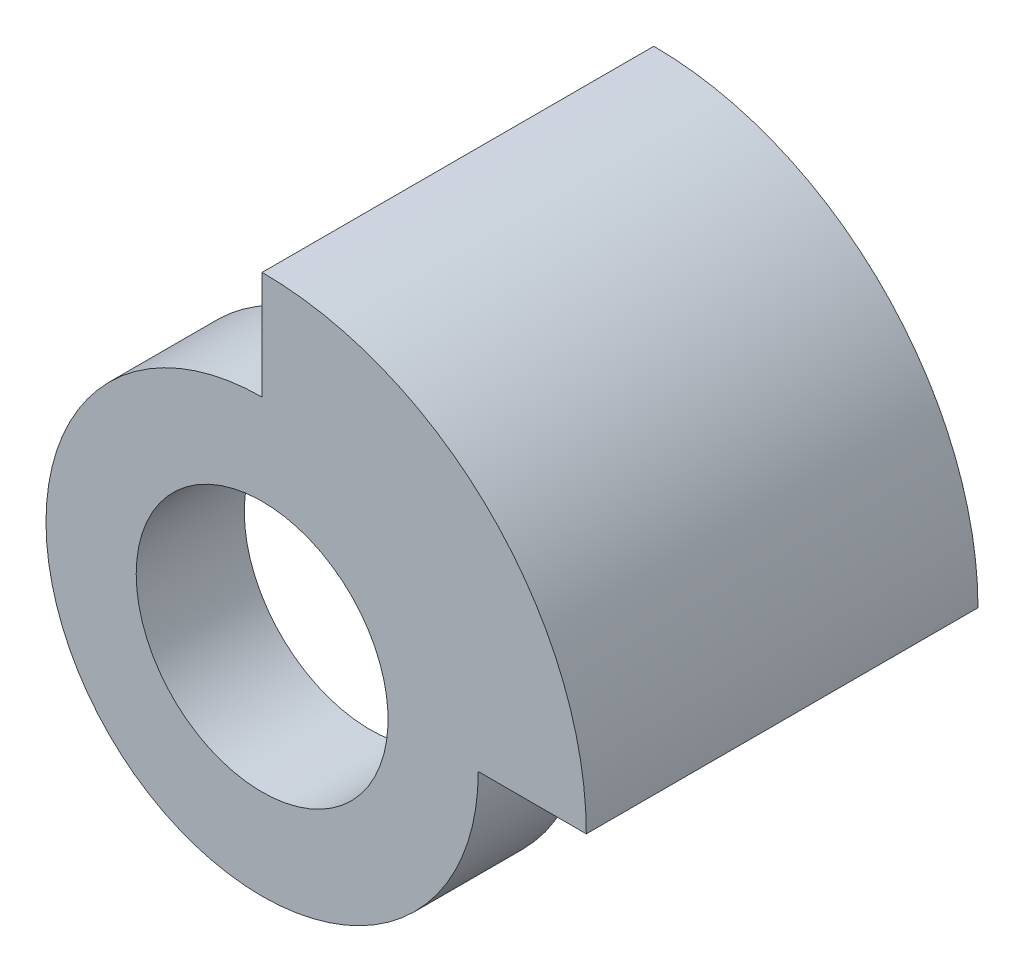
ISO-10303-21;
HEADER;
FILE_DESCRIPTION(('STEP AP214'),'2;1');
FILE_NAME('part.step','',(''),(''),'','','');
FILE_SCHEMA(('AUTOMOTIVE_DESIGN { 1 0 10303 214 1 1 1 1 }'));
ENDSEC;
DATA;
#1=APPLICATION_CONTEXT('core data for automotive mechanical design processes');
#2=APPLICATION_PROTOCOL_DEFINITION('international standard','automotive_design',2000,#1);
#3=PRODUCT_CONTEXT('',#1,'mechanical');
#4=PRODUCT('Part','Part','',(#3));
#5=PRODUCT_RELATED_PRODUCT_CATEGORY('part','',(#4));
#6=PRODUCT_DEFINITION_FORMATION('','',#4);
#7=PRODUCT_DEFINITION_CONTEXT('part definition',#1,'design');
#8=PRODUCT_DEFINITION('design','',#6,#7);
#9=PRODUCT_DEFINITION_SHAPE('','',#8);
#10=(LENGTH_UNIT() NAMED_UNIT(*) SI_UNIT(.MILLI.,.METRE.));
#11=(NAMED_UNIT(*) PLANE_ANGLE_UNIT() SI_UNIT($,.RADIAN.));
#12=(NAMED_UNIT(*) SI_UNIT($,.STERADIAN.) SOLID_ANGLE_UNIT());
#13=UNCERTAINTY_MEASURE_WITH_UNIT(LENGTH_MEASURE(1.E-05),#10,'distance_accuracy_value','');
#14=(GEOMETRIC_REPRESENTATION_CONTEXT(3) GLOBAL_UNCERTAINTY_ASSIGNED_CONTEXT((#13)) GLOBAL_UNIT_ASSIGNED_CONTEXT((#10,
#11,#12)) REPRESENTATION_CONTEXT('',''));
#15=CARTESIAN_POINT('',(0.,0.,0.));
#16=DIRECTION('',(0.,0.,1.));
#17=DIRECTION('',(1.,0.,0.));
#18=AXIS2_PLACEMENT_3D('',#15,#16,#17);
#19=CARTESIAN_POINT('',(0.,0.,0.));
#20=DIRECTION('',(0.,0.,1.));
#21=DIRECTION('',(1.,0.,0.));
#22=AXIS2_PLACEMENT_3D('',#19,#20,#21);
#23=PLANE('',#22);
#24=CARTESIAN_POINT('',(0.,0.,0.));
#25=DIRECTION('',(0.,0.,1.));
#26=DIRECTION('',(1.,0.,0.));
#27=AXIS2_PLACEMENT_3D('',#24,#25,#26);
#28=CIRCLE('',#27,11.1);
#29=CARTESIAN_POINT('',(-11.1,0.,0.));
#30=VERTEX_POINT('',#29);
#31=EDGE_CURVE('E126',#30,#30,#28,.T.);
#32=ORIENTED_EDGE('',*,*,#31,.T.);
#33=EDGE_LOOP('',(#32));
#34=FACE_BOUND('',#33,.T.);
#35=DIRECTION('',(0.,-1.,0.));
#36=VECTOR('',#35,1.);
#37=CARTESIAN_POINT('',(0.,0.,0.));
#38=LINE('',#37,#36);
#39=CARTESIAN_POINT('',(0.,19.4,0.));
#40=VERTEX_POINT('',#39);
#41=CARTESIAN_POINT('',(0.,19.0513784319709,0.));
#42=VERTEX_POINT('',#41);
#43=EDGE_CURVE('E123',#40,#42,#38,.T.);
#44=ORIENTED_EDGE('',*,*,#43,.F.);
#45=CARTESIAN_POINT('',(0.,0.,0.));
#46=DIRECTION('',(0.,0.,-1.));
#47=DIRECTION('',(-1.,0.,0.));
#48=AXIS2_PLACEMENT_3D('',#45,#46,#47);
#49=CIRCLE('',#48,19.4);
#50=CARTESIAN_POINT('',(19.4,0.,0.));
#51=VERTEX_POINT('',#50);
#52=EDGE_CURVE('E114',#40,#51,#49,.T.);
#53=ORIENTED_EDGE('',*,*,#52,.T.);
#54=DIRECTION('',(-1.,0.,0.));
#55=VECTOR('',#54,1.);
#56=CARTESIAN_POINT('',(0.,0.,0.));
#57=LINE('',#56,#55);
#58=CARTESIAN_POINT('',(19.0513784319709,0.,0.));
#59=VERTEX_POINT('',#58);
#60=EDGE_CURVE('E76',#51,#59,#57,.T.);
#61=ORIENTED_EDGE('',*,*,#60,.T.);
#62=CARTESIAN_POINT('',(0.,0.,0.));
#63=DIRECTION('',(0.,0.,1.));
#64=DIRECTION('',(1.,0.,0.));
#65=AXIS2_PLACEMENT_3D('',#62,#63,#64);
#66=CIRCLE('',#65,19.0513784319709);
#67=EDGE_CURVE('E135',#42,#59,#66,.T.);
#68=ORIENTED_EDGE('',*,*,#67,.F.);
#69=EDGE_LOOP('',(#44,#53,#61,#68));
#70=FACE_BOUND('',#69,.T.);
#71=ADVANCED_FACE('F36',(#34,#70),#23,.F.);
#72=CARTESIAN_POINT('',(0.,0.,9.525));
#73=DIRECTION('',(0.,0.,-1.));
#74=DIRECTION('',(-1.,0.,0.));
#75=AXIS2_PLACEMENT_3D('',#72,#73,#74);
#76=CYLINDRICAL_SURFACE('',#75,28.575);
#77=DIRECTION('',(0.,0.,-1.));
#78=VECTOR('',#77,1.);
#79=CARTESIAN_POINT('',(28.575,0.,9.525));
#80=LINE('',#79,#78);
#81=CARTESIAN_POINT('',(28.575,0.,9.525));
#82=VERTEX_POINT('',#81);
#83=CARTESIAN_POINT('',(28.575,0.,-25.));
#84=VERTEX_POINT('',#83);
#85=EDGE_CURVE('E60',#82,#84,#80,.T.);
#86=ORIENTED_EDGE('',*,*,#85,.T.);
#87=CARTESIAN_POINT('',(0.,0.,-25.));
#88=DIRECTION('',(0.,0.,-1.));
#89=DIRECTION('',(-1.,0.,0.));
#90=AXIS2_PLACEMENT_3D('',#87,#88,#89);
#91=CIRCLE('',#90,28.575);
#92=CARTESIAN_POINT('',(0.,28.575,-25.));
#93=VERTEX_POINT('',#92);
#94=EDGE_CURVE('E97',#93,#84,#91,.T.);
#95=ORIENTED_EDGE('',*,*,#94,.F.);
#96=DIRECTION('',(0.,0.,-1.));
#97=VECTOR('',#96,1.);
#98=CARTESIAN_POINT('',(0.,28.575,9.525));
#99=LINE('',#98,#97);
#100=CARTESIAN_POINT('',(0.,28.575,9.525));
#101=VERTEX_POINT('',#100);
#102=EDGE_CURVE('E11',#101,#93,#99,.T.);
#103=ORIENTED_EDGE('',*,*,#102,.F.);
#104=CARTESIAN_POINT('',(0.,0.,9.525));
#105=DIRECTION('',(0.,0.,1.));
#106=DIRECTION('',(1.,0.,0.));
#107=AXIS2_PLACEMENT_3D('',#104,#105,#106);
#108=CIRCLE('',#107,28.575);
#109=EDGE_CURVE('E99',#101,#82,#108,.F.);
#110=ORIENTED_EDGE('',*,*,#109,.T.);
#111=EDGE_LOOP('',(#86,#95,#103,#110));
#112=FACE_BOUND('',#111,.T.);
#113=ADVANCED_FACE('F38',(#112),#76,.T.);
#114=CARTESIAN_POINT('',(0.,0.,9.525));
#115=DIRECTION('',(1.,0.,0.));
#116=DIRECTION('',(0.,0.,-1.));
#117=AXIS2_PLACEMENT_3D('',#114,#115,#116);
#118=PLANE('',#117);
#119=ORIENTED_EDGE('',*,*,#102,.T.);
#120=DIRECTION('',(0.,1.,0.));
#121=VECTOR('',#120,1.);
#122=CARTESIAN_POINT('',(0.,0.,-25.));
#123=LINE('',#122,#121);
#124=CARTESIAN_POINT('',(0.,19.4,-25.));
#125=VERTEX_POINT('',#124);
#126=EDGE_CURVE('E113',#125,#93,#123,.T.);
#127=ORIENTED_EDGE('',*,*,#126,.F.);
#128=DIRECTION('',(0.,0.,1.));
#129=VECTOR('',#128,1.);
#130=CARTESIAN_POINT('',(0.,19.4,-25.));
#131=LINE('',#130,#129);
#132=EDGE_CURVE('E119',#125,#40,#131,.T.);
#133=ORIENTED_EDGE('',*,*,#132,.T.);
#134=ORIENTED_EDGE('',*,*,#43,.T.);
#135=DIRECTION('',(0.,0.,-1.));
#136=VECTOR('',#135,1.);
#137=CARTESIAN_POINT('',(0.,19.0513784319709,9.525));
#138=LINE('',#137,#136);
#139=CARTESIAN_POINT('',(0.,19.0513784319709,9.525));
#140=VERTEX_POINT('',#139);
#141=EDGE_CURVE('E44',#140,#42,#138,.T.);
#142=ORIENTED_EDGE('',*,*,#141,.F.);
#143=DIRECTION('',(0.,-1.,0.));
#144=VECTOR('',#143,1.);
#145=CARTESIAN_POINT('',(0.,0.,9.525));
#146=LINE('',#145,#144);
#147=EDGE_CURVE('E125',#101,#140,#146,.T.);
#148=ORIENTED_EDGE('',*,*,#147,.F.);
#149=EDGE_LOOP('',(#119,#127,#133,#134,#142,#148));
#150=FACE_BOUND('',#149,.T.);
#151=ADVANCED_FACE('F149',(#150),#118,.F.);
#152=CARTESIAN_POINT('',(0.,0.,9.525));
#153=DIRECTION('',(0.,0.,-1.));
#154=DIRECTION('',(-1.,0.,0.));
#155=AXIS2_PLACEMENT_3D('',#152,#153,#154);
#156=CYLINDRICAL_SURFACE('',#155,19.0513784319709);
#157=ORIENTED_EDGE('',*,*,#67,.T.);
#158=DIRECTION('',(0.,0.,-1.));
#159=VECTOR('',#158,1.);
#160=CARTESIAN_POINT('',(19.0513784319709,0.,9.525));
#161=LINE('',#160,#159);
#162=CARTESIAN_POINT('',(19.0513784319709,0.,9.525));
#163=VERTEX_POINT('',#162);
#164=EDGE_CURVE('E101',#163,#59,#161,.T.);
#165=ORIENTED_EDGE('',*,*,#164,.F.);
#166=CARTESIAN_POINT('',(0.,0.,9.525));
#167=DIRECTION('',(0.,0.,1.));
#168=DIRECTION('',(1.,0.,0.));
#169=AXIS2_PLACEMENT_3D('',#166,#167,#168);
#170=CIRCLE('',#169,19.0513784319709);
#171=EDGE_CURVE('E128',#140,#163,#170,.T.);
#172=ORIENTED_EDGE('',*,*,#171,.F.);
#173=ORIENTED_EDGE('',*,*,#141,.T.);
#174=EDGE_LOOP('',(#157,#165,#172,#173));
#175=FACE_BOUND('',#174,.T.);
#176=ADVANCED_FACE('F145',(#175),#156,.T.);
#177=CARTESIAN_POINT('',(0.,0.,9.525));
#178=DIRECTION('',(0.,-1.,0.));
#179=DIRECTION('',(1.,0.,0.));
#180=AXIS2_PLACEMENT_3D('',#177,#178,#179);
#181=PLANE('',#180);
#182=ORIENTED_EDGE('',*,*,#60,.F.);
#183=DIRECTION('',(0.,0.,1.));
#184=VECTOR('',#183,1.);
#185=CARTESIAN_POINT('',(19.4,0.,-25.));
#186=LINE('',#185,#184);
#187=CARTESIAN_POINT('',(19.4,0.,-25.));
#188=VERTEX_POINT('',#187);
#189=EDGE_CURVE('E51',#188,#51,#186,.T.);
#190=ORIENTED_EDGE('',*,*,#189,.F.);
#191=DIRECTION('',(-1.,0.,0.));
#192=VECTOR('',#191,1.);
#193=CARTESIAN_POINT('',(0.,0.,-25.));
#194=LINE('',#193,#192);
#195=EDGE_CURVE('E104',#84,#188,#194,.T.);
#196=ORIENTED_EDGE('',*,*,#195,.F.);
#197=ORIENTED_EDGE('',*,*,#85,.F.);
#198=DIRECTION('',(-1.,0.,0.));
#199=VECTOR('',#198,1.);
#200=CARTESIAN_POINT('',(0.,0.,9.525));
#201=LINE('',#200,#199);
#202=EDGE_CURVE('E130',#82,#163,#201,.T.);
#203=ORIENTED_EDGE('',*,*,#202,.T.);
#204=ORIENTED_EDGE('',*,*,#164,.T.);
#205=EDGE_LOOP('',(#182,#190,#196,#197,#203,#204));
#206=FACE_BOUND('',#205,.T.);
#207=ADVANCED_FACE('F105',(#206),#181,.T.);
#208=CARTESIAN_POINT('',(0.,0.,9.525));
#209=DIRECTION('',(0.,0.,-1.));
#210=DIRECTION('',(-1.,0.,0.));
#211=AXIS2_PLACEMENT_3D('',#208,#209,#210);
#212=CYLINDRICAL_SURFACE('',#211,11.1);
#213=CARTESIAN_POINT('',(0.,0.,9.525));
#214=DIRECTION('',(0.,0.,1.));
#215=DIRECTION('',(1.,0.,0.));
#216=AXIS2_PLACEMENT_3D('',#213,#214,#215);
#217=CIRCLE('',#216,11.1);
#218=CARTESIAN_POINT('',(-11.1,0.,9.525));
#219=VERTEX_POINT('',#218);
#220=EDGE_CURVE('E102',#219,#219,#217,.T.);
#221=CARTESIAN_POINT('',(-11.1,0.,9.525));
#222=CARTESIAN_POINT('',(-11.1,0.,9.42578125));
#223=CARTESIAN_POINT('',(-11.1,0.,9.3265625));
#224=CARTESIAN_POINT('',(-11.1,0.,9.128125));
#225=CARTESIAN_POINT('',(-11.1,0.,9.02890625));
#226=CARTESIAN_POINT('',(-11.1,0.,8.83046875));
#227=CARTESIAN_POINT('',(-11.1,0.,8.73125));
#228=CARTESIAN_POINT('',(-11.1,0.,8.5328125));
#229=CARTESIAN_POINT('',(-11.1,0.,8.43359375));
#230=CARTESIAN_POINT('',(-11.1,0.,8.23515625));
#231=CARTESIAN_POINT('',(-11.1,0.,8.1359375));
#232=CARTESIAN_POINT('',(-11.1,0.,7.9375));
#233=CARTESIAN_POINT('',(-11.1,0.,7.83828125));
#234=CARTESIAN_POINT('',(-11.1,0.,7.63984375));
#235=CARTESIAN_POINT('',(-11.1,0.,7.540625));
#236=CARTESIAN_POINT('',(-11.1,0.,7.3421875));
#237=CARTESIAN_POINT('',(-11.1,0.,7.24296875));
#238=CARTESIAN_POINT('',(-11.1,0.,7.04453125));
#239=CARTESIAN_POINT('',(-11.1,0.,6.9453125));
#240=CARTESIAN_POINT('',(-11.1,0.,6.746875));
#241=CARTESIAN_POINT('',(-11.1,0.,6.64765625));
#242=CARTESIAN_POINT('',(-11.1,0.,6.44921875));
#243=CARTESIAN_POINT('',(-11.1,0.,6.35));
#244=CARTESIAN_POINT('',(-11.1,0.,6.1515625));
#245=CARTESIAN_POINT('',(-11.1,0.,6.05234375));
#246=CARTESIAN_POINT('',(-11.1,0.,5.85390625));
#247=CARTESIAN_POINT('',(-11.1,0.,5.7546875));
#248=CARTESIAN_POINT('',(-11.1,0.,5.55625));
#249=CARTESIAN_POINT('',(-11.1,0.,5.45703125));
#250=CARTESIAN_POINT('',(-11.1,0.,5.25859375));
#251=CARTESIAN_POINT('',(-11.1,0.,5.159375));
#252=CARTESIAN_POINT('',(-11.1,0.,4.9609375));
#253=CARTESIAN_POINT('',(-11.1,0.,4.86171875));
#254=CARTESIAN_POINT('',(-11.1,0.,4.66328125));
#255=CARTESIAN_POINT('',(-11.1,0.,4.5640625));
#256=CARTESIAN_POINT('',(-11.1,0.,4.365625));
#257=CARTESIAN_POINT('',(-11.1,0.,4.26640625));
#258=CARTESIAN_POINT('',(-11.1,0.,4.06796875));
#259=CARTESIAN_POINT('',(-11.1,0.,3.96875));
#260=CARTESIAN_POINT('',(-11.1,0.,3.7703125));
#261=CARTESIAN_POINT('',(-11.1,0.,3.67109375));
#262=CARTESIAN_POINT('',(-11.1,0.,3.47265625));
#263=CARTESIAN_POINT('',(-11.1,0.,3.3734375));
#264=CARTESIAN_POINT('',(-11.1,0.,3.175));
#265=CARTESIAN_POINT('',(-11.1,0.,3.07578125));
#266=CARTESIAN_POINT('',(-11.1,0.,2.87734375));
#267=CARTESIAN_POINT('',(-11.1,0.,2.778125));
#268=CARTESIAN_POINT('',(-11.1,0.,2.5796875));
#269=CARTESIAN_POINT('',(-11.1,0.,2.48046875));
#270=CARTESIAN_POINT('',(-11.1,0.,2.28203125));
#271=CARTESIAN_POINT('',(-11.1,0.,2.1828125));
#272=CARTESIAN_POINT('',(-11.1,0.,1.984375));
#273=CARTESIAN_POINT('',(-11.1,0.,1.88515625));
#274=CARTESIAN_POINT('',(-11.1,0.,1.68671875));
#275=CARTESIAN_POINT('',(-11.1,0.,1.5875));
#276=CARTESIAN_POINT('',(-11.1,0.,1.3890625));
#277=CARTESIAN_POINT('',(-11.1,0.,1.28984375));
#278=CARTESIAN_POINT('',(-11.1,0.,1.09140625));
#279=CARTESIAN_POINT('',(-11.1,0.,0.992187500000001));
#280=CARTESIAN_POINT('',(-11.1,0.,0.793750000000001));
#281=CARTESIAN_POINT('',(-11.1,0.,0.69453125));
#282=CARTESIAN_POINT('',(-11.1,0.,0.49609375));
#283=CARTESIAN_POINT('',(-11.1,0.,0.396875));
#284=CARTESIAN_POINT('',(-11.1,0.,0.1984375));
#285=CARTESIAN_POINT('',(-11.1,0.,0.0992187500000001));
#286=CARTESIAN_POINT('',(-11.1,0.,0.));
#287=B_SPLINE_CURVE_WITH_KNOTS('',3,(#221,#222,#223,#224,#225,#226,#227,#228,#229,#230,#231,
#232,#233,#234,#235,#236,#237,#238,#239,#240,#241,#242,#243,#244,#245,#246,#247,#248,#249,#250,
#251,#252,#253,#254,#255,#256,#257,#258,#259,#260,#261,#262,#263,#264,#265,#266,#267,#268,#269,
#270,#271,#272,#273,#274,#275,#276,#277,#278,#279,#280,#281,#282,#283,#284,#285,#286),
.UNSPECIFIED.,.F.,.F.,(4,2,2,2,2,2,2,2,2,2,2,2,2,2,2,2,2,2,2,2,2,2,2,2,2,2,2,2,2,2,2,2,4),(0.,
0.29765625,0.5953125,0.892968750000001,1.190625,1.48828125,1.7859375,2.08359375,2.38125,
2.67890625,2.9765625,3.27421875,3.571875,3.86953125,4.1671875,4.46484375,4.7625,5.06015625,
5.3578125,5.65546875,5.953125,6.25078125,6.5484375,6.84609375,7.14375,7.44140625,7.7390625,
8.03671875,8.334375,8.63203125,8.9296875,9.22734375,9.525),.UNSPECIFIED.);
#288=EDGE_CURVE('BSEAM159',#219,#30,#287,.T.);
#289=ORIENTED_EDGE('',*,*,#220,.T.);
#290=ORIENTED_EDGE('',*,*,#31,.F.);
#291=ORIENTED_EDGE('',*,*,#288,.T.);
#292=ORIENTED_EDGE('',*,*,#288,.F.);
#293=EDGE_LOOP('',(#289,#291,#290,#292));
#294=FACE_BOUND('',#293,.T.);
#295=ADVANCED_FACE('F159',(#294),#212,.F.);
#296=CARTESIAN_POINT('',(0.,0.,9.525));
#297=DIRECTION('',(0.,0.,1.));
#298=DIRECTION('',(1.,0.,0.));
#299=AXIS2_PLACEMENT_3D('',#296,#297,#298);
#300=PLANE('',#299);
#301=ORIENTED_EDGE('',*,*,#109,.F.);
#302=ORIENTED_EDGE('',*,*,#147,.T.);
#303=ORIENTED_EDGE('',*,*,#171,.T.);
#304=ORIENTED_EDGE('',*,*,#202,.F.);
#305=EDGE_LOOP('',(#301,#302,#303,#304));
#306=FACE_BOUND('',#305,.T.);
#307=ORIENTED_EDGE('',*,*,#220,.F.);
#308=EDGE_LOOP('',(#307));
#309=FACE_BOUND('',#308,.T.);
#310=ADVANCED_FACE('F152',(#306,#309),#300,.T.);
#311=CARTESIAN_POINT('',(0.,0.,-25.));
#312=DIRECTION('',(0.,0.,1.));
#313=DIRECTION('',(1.,0.,0.));
#314=AXIS2_PLACEMENT_3D('',#311,#312,#313);
#315=CYLINDRICAL_SURFACE('',#314,19.4);
#316=ORIENTED_EDGE('',*,*,#52,.F.);
#317=ORIENTED_EDGE('',*,*,#132,.F.);
#318=CARTESIAN_POINT('',(0.,0.,-25.));
#319=DIRECTION('',(0.,0.,-1.));
#320=DIRECTION('',(-1.,0.,0.));
#321=AXIS2_PLACEMENT_3D('',#318,#319,#320);
#322=CIRCLE('',#321,19.4);
#323=EDGE_CURVE('E108',#125,#188,#322,.T.);
#324=ORIENTED_EDGE('',*,*,#323,.T.);
#325=ORIENTED_EDGE('',*,*,#189,.T.);
#326=EDGE_LOOP('',(#316,#317,#324,#325));
#327=FACE_BOUND('',#326,.T.);
#328=ADVANCED_FACE('F150',(#327),#315,.F.);
#329=CARTESIAN_POINT('',(0.,0.,-25.));
#330=DIRECTION('',(0.,0.,-1.));
#331=DIRECTION('',(-1.,0.,0.));
#332=AXIS2_PLACEMENT_3D('',#329,#330,#331);
#333=PLANE('',#332);
#334=ORIENTED_EDGE('',*,*,#94,.T.);
#335=ORIENTED_EDGE('',*,*,#195,.T.);
#336=ORIENTED_EDGE('',*,*,#323,.F.);
#337=ORIENTED_EDGE('',*,*,#126,.T.);
#338=EDGE_LOOP('',(#334,#335,#336,#337));
#339=FACE_BOUND('',#338,.T.);
#340=ADVANCED_FACE('F111',(#339),#333,.T.);
#341=CLOSED_SHELL('',(#71,#113,#151,#176,#207,#295,#310,#328,#340));
#342=MANIFOLD_SOLID_BREP('B2',#341);
#343=ADVANCED_BREP_SHAPE_REPRESENTATION('',(#18,#342),#14);
#344=SHAPE_DEFINITION_REPRESENTATION(#9,#343);
ENDSEC;
END-ISO-10303-21;
